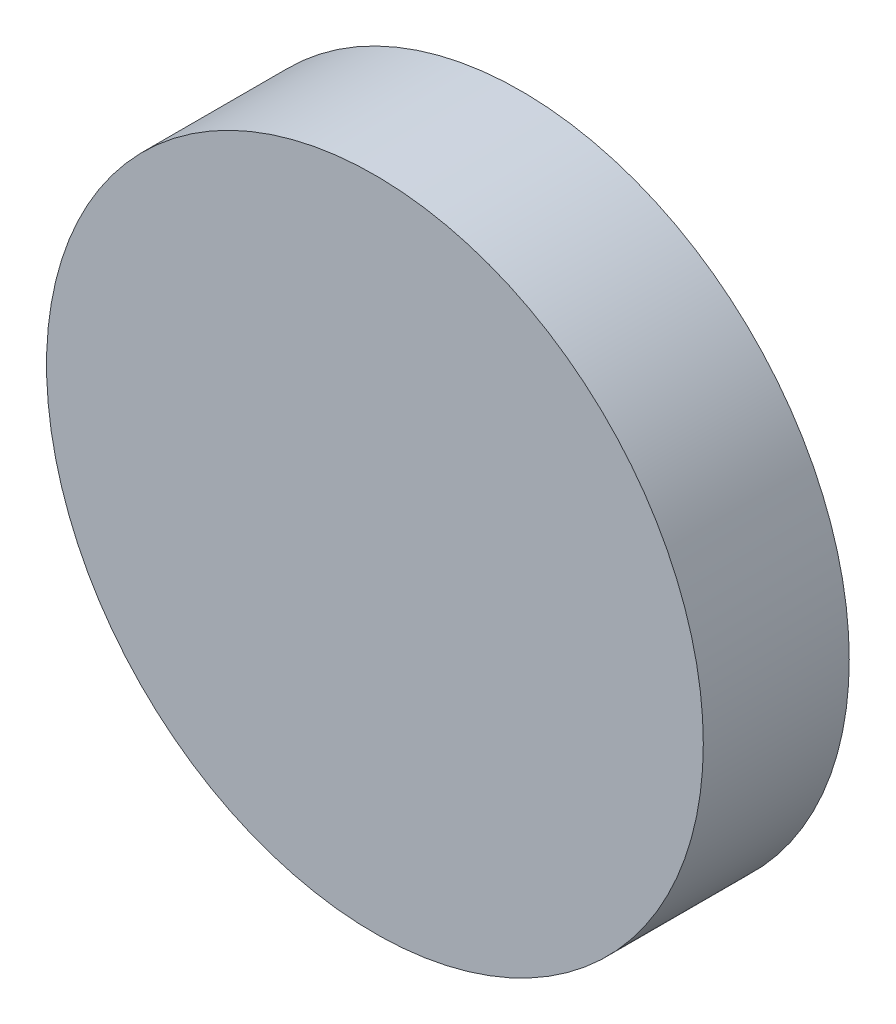
ISO-10303-21;
HEADER;
FILE_DESCRIPTION(('STEP AP214'),'2;1');
FILE_NAME('part.step','',(''),(''),'','','');
FILE_SCHEMA(('AUTOMOTIVE_DESIGN { 1 0 10303 214 1 1 1 1 }'));
ENDSEC;
DATA;
#1=APPLICATION_CONTEXT('core data for automotive mechanical design processes');
#2=APPLICATION_PROTOCOL_DEFINITION('international standard','automotive_design',2000,#1);
#3=PRODUCT_CONTEXT('',#1,'mechanical');
#4=PRODUCT('Part','Part','',(#3));
#5=PRODUCT_RELATED_PRODUCT_CATEGORY('part','',(#4));
#6=PRODUCT_DEFINITION_FORMATION('','',#4);
#7=PRODUCT_DEFINITION_CONTEXT('part definition',#1,'design');
#8=PRODUCT_DEFINITION('design','',#6,#7);
#9=PRODUCT_DEFINITION_SHAPE('','',#8);
#10=(LENGTH_UNIT() NAMED_UNIT(*) SI_UNIT(.MILLI.,.METRE.));
#11=(NAMED_UNIT(*) PLANE_ANGLE_UNIT() SI_UNIT($,.RADIAN.));
#12=(NAMED_UNIT(*) SI_UNIT($,.STERADIAN.) SOLID_ANGLE_UNIT());
#13=UNCERTAINTY_MEASURE_WITH_UNIT(LENGTH_MEASURE(1.E-05),#10,'distance_accuracy_value','');
#14=(GEOMETRIC_REPRESENTATION_CONTEXT(3) GLOBAL_UNCERTAINTY_ASSIGNED_CONTEXT((#13)) GLOBAL_UNIT_ASSIGNED_CONTEXT((#10,
#11,#12)) REPRESENTATION_CONTEXT('',''));
#15=CARTESIAN_POINT('',(0.,0.,0.));
#16=DIRECTION('',(0.,0.,1.));
#17=DIRECTION('',(1.,0.,0.));
#18=AXIS2_PLACEMENT_3D('',#15,#16,#17);
#19=CARTESIAN_POINT('',(0.,0.,6.));
#20=DIRECTION('',(0.,0.,-1.));
#21=DIRECTION('',(-1.,0.,0.));
#22=AXIS2_PLACEMENT_3D('',#19,#20,#21);
#23=CYLINDRICAL_SURFACE('',#22,13.5);
#24=CARTESIAN_POINT('',(0.,0.,6.));
#25=DIRECTION('',(0.,0.,1.));
#26=DIRECTION('',(1.,0.,0.));
#27=AXIS2_PLACEMENT_3D('',#24,#25,#26);
#28=CIRCLE('',#27,13.5);
#29=CARTESIAN_POINT('',(13.5,0.,6.));
#30=VERTEX_POINT('',#29);
#31=EDGE_CURVE('E10',#30,#30,#28,.T.);
#32=ORIENTED_EDGE('',*,*,#31,.F.);
#33=EDGE_LOOP('',(#32));
#34=FACE_BOUND('',#33,.T.);
#35=CARTESIAN_POINT('',(0.,0.,0.));
#36=DIRECTION('',(0.,0.,1.));
#37=DIRECTION('',(1.,0.,0.));
#38=AXIS2_PLACEMENT_3D('',#35,#36,#37);
#39=CIRCLE('',#38,13.5);
#40=CARTESIAN_POINT('',(13.5,0.,0.));
#41=VERTEX_POINT('',#40);
#42=EDGE_CURVE('E34',#41,#41,#39,.T.);
#43=ORIENTED_EDGE('',*,*,#42,.T.);
#44=EDGE_LOOP('',(#43));
#45=FACE_BOUND('',#44,.T.);
#46=ADVANCED_FACE('F31',(#34,#45),#23,.T.);
#47=CARTESIAN_POINT('',(0.,0.,6.));
#48=DIRECTION('',(0.,0.,1.));
#49=DIRECTION('',(1.,0.,0.));
#50=AXIS2_PLACEMENT_3D('',#47,#48,#49);
#51=PLANE('',#50);
#52=ORIENTED_EDGE('',*,*,#31,.T.);
#53=EDGE_LOOP('',(#52));
#54=FACE_BOUND('',#53,.T.);
#55=ADVANCED_FACE('F46',(#54),#51,.T.);
#56=CARTESIAN_POINT('',(0.,0.,0.));
#57=DIRECTION('',(0.,0.,1.));
#58=DIRECTION('',(1.,0.,0.));
#59=AXIS2_PLACEMENT_3D('',#56,#57,#58);
#60=PLANE('',#59);
#61=ORIENTED_EDGE('',*,*,#42,.F.);
#62=EDGE_LOOP('',(#61));
#63=FACE_BOUND('',#62,.T.);
#64=ADVANCED_FACE('F44',(#63),#60,.F.);
#65=CLOSED_SHELL('',(#46,#55,#64));
#66=MANIFOLD_SOLID_BREP('B2',#65);
#67=ADVANCED_BREP_SHAPE_REPRESENTATION('',(#18,#66),#14);
#68=SHAPE_DEFINITION_REPRESENTATION(#9,#67);
ENDSEC;
END-ISO-10303-21;
